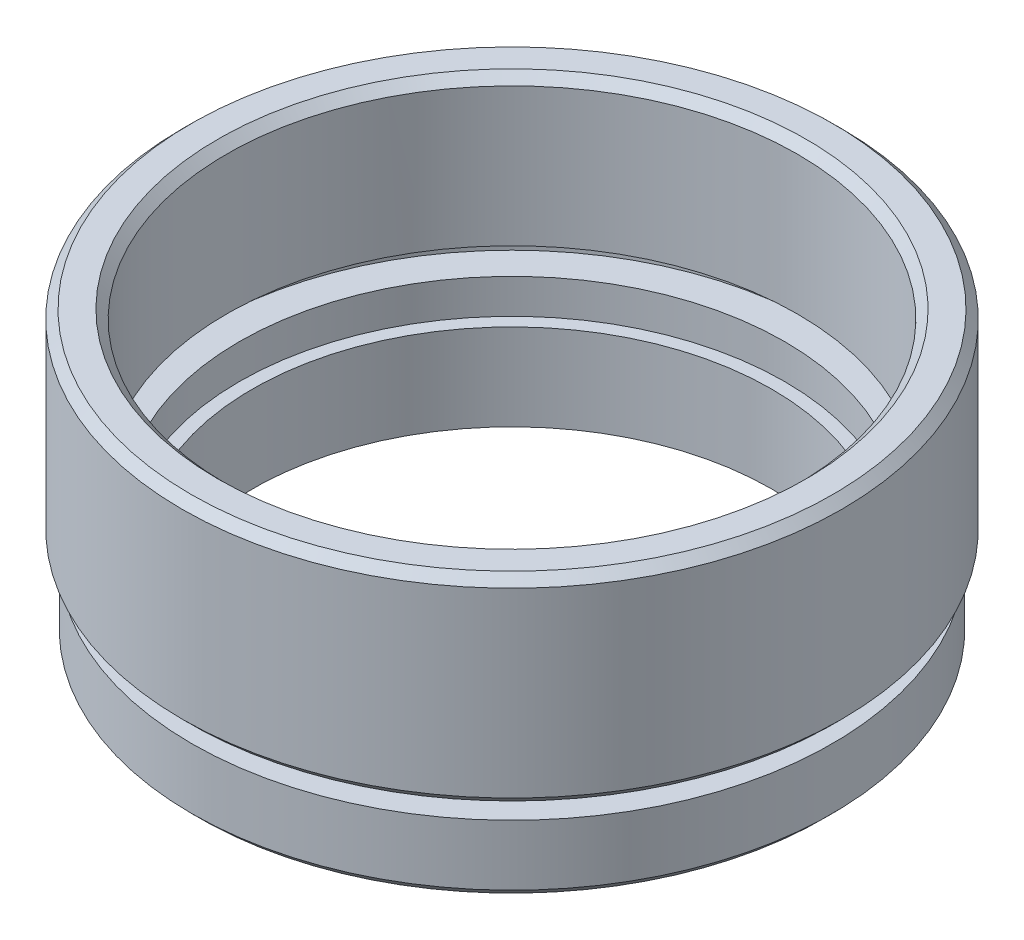
ISO-10303-21;
HEADER;
FILE_DESCRIPTION(('STEP AP214'),'2;1');
FILE_NAME('part.step','',(''),(''),'','','');
FILE_SCHEMA(('AUTOMOTIVE_DESIGN { 1 0 10303 214 1 1 1 1 }'));
ENDSEC;
DATA;
#1=APPLICATION_CONTEXT('core data for automotive mechanical design processes');
#2=APPLICATION_PROTOCOL_DEFINITION('international standard','automotive_design',2000,#1);
#3=PRODUCT_CONTEXT('',#1,'mechanical');
#4=PRODUCT('Part','Part','',(#3));
#5=PRODUCT_RELATED_PRODUCT_CATEGORY('part','',(#4));
#6=PRODUCT_DEFINITION_FORMATION('','',#4);
#7=PRODUCT_DEFINITION_CONTEXT('part definition',#1,'design');
#8=PRODUCT_DEFINITION('design','',#6,#7);
#9=PRODUCT_DEFINITION_SHAPE('','',#8);
#10=(LENGTH_UNIT() NAMED_UNIT(*) SI_UNIT(.MILLI.,.METRE.));
#11=(NAMED_UNIT(*) PLANE_ANGLE_UNIT() SI_UNIT($,.RADIAN.));
#12=(NAMED_UNIT(*) SI_UNIT($,.STERADIAN.) SOLID_ANGLE_UNIT());
#13=UNCERTAINTY_MEASURE_WITH_UNIT(LENGTH_MEASURE(1.E-05),#10,'distance_accuracy_value','');
#14=(GEOMETRIC_REPRESENTATION_CONTEXT(3) GLOBAL_UNCERTAINTY_ASSIGNED_CONTEXT((#13)) GLOBAL_UNIT_ASSIGNED_CONTEXT((#10,
#11,#12)) REPRESENTATION_CONTEXT('',''));
#15=CARTESIAN_POINT('',(0.,0.,0.));
#16=DIRECTION('',(0.,0.,1.));
#17=DIRECTION('',(1.,0.,0.));
#18=AXIS2_PLACEMENT_3D('',#15,#16,#17);
#19=CARTESIAN_POINT('',(0.,0.,0.));
#20=DIRECTION('',(0.,-1.,0.));
#21=DIRECTION('',(0.,0.,-1.));
#22=AXIS2_PLACEMENT_3D('',#19,#20,#21);
#23=CYLINDRICAL_SURFACE('',#22,15.);
#24=CARTESIAN_POINT('',(0.,0.,0.));
#25=DIRECTION('',(0.,-1.,0.));
#26=DIRECTION('',(0.,0.,-1.));
#27=AXIS2_PLACEMENT_3D('',#24,#25,#26);
#28=CIRCLE('',#27,15.);
#29=CARTESIAN_POINT('',(0.,0.,-15.));
#30=VERTEX_POINT('',#29);
#31=EDGE_CURVE('E67',#30,#30,#28,.T.);
#32=ORIENTED_EDGE('',*,*,#31,.T.);
#33=EDGE_LOOP('',(#32));
#34=FACE_BOUND('',#33,.T.);
#35=CARTESIAN_POINT('',(0.,5.,0.));
#36=DIRECTION('',(0.,-1.,0.));
#37=DIRECTION('',(0.,0.,-1.));
#38=AXIS2_PLACEMENT_3D('',#35,#36,#37);
#39=CIRCLE('',#38,15.);
#40=CARTESIAN_POINT('',(0.,5.,-15.));
#41=VERTEX_POINT('',#40);
#42=EDGE_CURVE('E94',#41,#41,#39,.T.);
#43=ORIENTED_EDGE('',*,*,#42,.F.);
#44=EDGE_LOOP('',(#43));
#45=FACE_BOUND('',#44,.T.);
#46=ADVANCED_FACE('F35',(#34,#45),#23,.F.);
#47=CARTESIAN_POINT('',(15.,0.,0.));
#48=DIRECTION('',(0.,-1.,0.));
#49=DIRECTION('',(0.,0.,-1.));
#50=AXIS2_PLACEMENT_3D('',#47,#48,#49);
#51=PLANE('',#50);
#52=CARTESIAN_POINT('',(0.,0.,0.));
#53=DIRECTION('',(0.,-1.,0.));
#54=DIRECTION('',(0.,0.,-1.));
#55=AXIS2_PLACEMENT_3D('',#52,#53,#54);
#56=CIRCLE('',#55,18.);
#57=CARTESIAN_POINT('',(0.,0.,-18.));
#58=VERTEX_POINT('',#57);
#59=EDGE_CURVE('E42',#58,#58,#56,.T.);
#60=ORIENTED_EDGE('',*,*,#59,.T.);
#61=EDGE_LOOP('',(#60));
#62=FACE_BOUND('',#61,.T.);
#63=ORIENTED_EDGE('',*,*,#31,.F.);
#64=EDGE_LOOP('',(#63));
#65=FACE_BOUND('',#64,.T.);
#66=ADVANCED_FACE('F102',(#62,#65),#51,.T.);
#67=CARTESIAN_POINT('',(0.,0.,0.));
#68=DIRECTION('',(0.,-1.,0.));
#69=DIRECTION('',(0.,0.,-1.));
#70=AXIS2_PLACEMENT_3D('',#67,#68,#69);
#71=CYLINDRICAL_SURFACE('',#70,18.5);
#72=CARTESIAN_POINT('',(0.,0.500000000000004,0.));
#73=DIRECTION('',(0.,-1.,0.));
#74=DIRECTION('',(0.,0.,-1.));
#75=AXIS2_PLACEMENT_3D('',#72,#73,#74);
#76=CIRCLE('',#75,18.5);
#77=CARTESIAN_POINT('',(0.,0.500000000000004,-18.5));
#78=VERTEX_POINT('',#77);
#79=EDGE_CURVE('E10',#78,#78,#76,.F.);
#80=ORIENTED_EDGE('',*,*,#79,.T.);
#81=EDGE_LOOP('',(#80));
#82=FACE_BOUND('',#81,.T.);
#83=CARTESIAN_POINT('',(0.,4.,0.));
#84=DIRECTION('',(0.,-1.,0.));
#85=DIRECTION('',(0.,0.,-1.));
#86=AXIS2_PLACEMENT_3D('',#83,#84,#85);
#87=CIRCLE('',#86,18.5);
#88=CARTESIAN_POINT('',(0.,4.,-18.5));
#89=VERTEX_POINT('',#88);
#90=EDGE_CURVE('E70',#89,#89,#87,.T.);
#91=ORIENTED_EDGE('',*,*,#90,.T.);
#92=EDGE_LOOP('',(#91));
#93=FACE_BOUND('',#92,.T.);
#94=ADVANCED_FACE('F108',(#82,#93),#71,.T.);
#95=CARTESIAN_POINT('',(18.5,4.,0.));
#96=DIRECTION('',(0.,1.,0.));
#97=DIRECTION('',(0.,0.,1.));
#98=AXIS2_PLACEMENT_3D('',#95,#96,#97);
#99=PLANE('',#98);
#100=CARTESIAN_POINT('',(0.,4.,0.));
#101=DIRECTION('',(0.,-1.,0.));
#102=DIRECTION('',(0.,0.,-1.));
#103=AXIS2_PLACEMENT_3D('',#100,#101,#102);
#104=CIRCLE('',#103,17.);
#105=CARTESIAN_POINT('',(0.,4.,-17.));
#106=VERTEX_POINT('',#105);
#107=EDGE_CURVE('E73',#106,#106,#104,.T.);
#108=ORIENTED_EDGE('',*,*,#107,.T.);
#109=EDGE_LOOP('',(#108));
#110=FACE_BOUND('',#109,.T.);
#111=ORIENTED_EDGE('',*,*,#90,.F.);
#112=EDGE_LOOP('',(#111));
#113=FACE_BOUND('',#112,.T.);
#114=ADVANCED_FACE('F140',(#110,#113),#99,.T.);
#115=CARTESIAN_POINT('',(0.,0.,0.));
#116=DIRECTION('',(0.,-1.,0.));
#117=DIRECTION('',(0.,0.,-1.));
#118=AXIS2_PLACEMENT_3D('',#115,#116,#117);
#119=CYLINDRICAL_SURFACE('',#118,17.);
#120=CARTESIAN_POINT('',(0.,5.,0.));
#121=DIRECTION('',(0.,-1.,0.));
#122=DIRECTION('',(0.,0.,-1.));
#123=AXIS2_PLACEMENT_3D('',#120,#121,#122);
#124=CIRCLE('',#123,17.);
#125=CARTESIAN_POINT('',(0.,5.,-17.));
#126=VERTEX_POINT('',#125);
#127=EDGE_CURVE('E76',#126,#126,#124,.T.);
#128=ORIENTED_EDGE('',*,*,#127,.T.);
#129=EDGE_LOOP('',(#128));
#130=FACE_BOUND('',#129,.T.);
#131=ORIENTED_EDGE('',*,*,#107,.F.);
#132=EDGE_LOOP('',(#131));
#133=FACE_BOUND('',#132,.T.);
#134=ADVANCED_FACE('F134',(#130,#133),#119,.T.);
#135=CARTESIAN_POINT('',(17.,5.,0.));
#136=DIRECTION('',(0.,-1.,0.));
#137=DIRECTION('',(0.,0.,-1.));
#138=AXIS2_PLACEMENT_3D('',#135,#136,#137);
#139=PLANE('',#138);
#140=CARTESIAN_POINT('',(0.,5.,0.));
#141=DIRECTION('',(0.,-1.,0.));
#142=DIRECTION('',(0.,0.,-1.));
#143=AXIS2_PLACEMENT_3D('',#140,#141,#142);
#144=CIRCLE('',#143,18.55);
#145=CARTESIAN_POINT('',(0.,5.,-18.55));
#146=VERTEX_POINT('',#145);
#147=EDGE_CURVE('E46',#146,#146,#144,.T.);
#148=ORIENTED_EDGE('',*,*,#147,.T.);
#149=EDGE_LOOP('',(#148));
#150=FACE_BOUND('',#149,.T.);
#151=ORIENTED_EDGE('',*,*,#127,.F.);
#152=EDGE_LOOP('',(#151));
#153=FACE_BOUND('',#152,.T.);
#154=ADVANCED_FACE('F130',(#150,#153),#139,.T.);
#155=CARTESIAN_POINT('',(0.,0.,0.));
#156=DIRECTION('',(0.,-1.,0.));
#157=DIRECTION('',(0.,0.,-1.));
#158=AXIS2_PLACEMENT_3D('',#155,#156,#157);
#159=CYLINDRICAL_SURFACE('',#158,19.05);
#160=CARTESIAN_POINT('',(0.,16.,0.));
#161=DIRECTION('',(0.,1.,0.));
#162=DIRECTION('',(0.,0.,1.));
#163=AXIS2_PLACEMENT_3D('',#160,#161,#162);
#164=CIRCLE('',#163,19.05);
#165=CARTESIAN_POINT('',(0.,16.,19.05));
#166=VERTEX_POINT('',#165);
#167=EDGE_CURVE('E50',#166,#166,#164,.F.);
#168=ORIENTED_EDGE('',*,*,#167,.T.);
#169=EDGE_LOOP('',(#168));
#170=FACE_BOUND('',#169,.T.);
#171=CARTESIAN_POINT('',(0.,5.50000000000001,0.));
#172=DIRECTION('',(0.,-1.,0.));
#173=DIRECTION('',(0.,0.,-1.));
#174=AXIS2_PLACEMENT_3D('',#171,#172,#173);
#175=CIRCLE('',#174,19.05);
#176=CARTESIAN_POINT('',(0.,5.50000000000001,-19.05));
#177=VERTEX_POINT('',#176);
#178=EDGE_CURVE('E55',#177,#177,#175,.F.);
#179=ORIENTED_EDGE('',*,*,#178,.T.);
#180=EDGE_LOOP('',(#179));
#181=FACE_BOUND('',#180,.T.);
#182=ADVANCED_FACE('F133',(#170,#181),#159,.T.);
#183=CARTESIAN_POINT('',(19.05,16.5,0.));
#184=DIRECTION('',(0.,1.,0.));
#185=DIRECTION('',(0.,0.,1.));
#186=AXIS2_PLACEMENT_3D('',#183,#184,#185);
#187=PLANE('',#186);
#188=CARTESIAN_POINT('',(0.,16.5,0.));
#189=DIRECTION('',(0.,1.,0.));
#190=DIRECTION('',(0.,0.,1.));
#191=AXIS2_PLACEMENT_3D('',#188,#189,#190);
#192=CIRCLE('',#191,17.);
#193=CARTESIAN_POINT('',(0.,16.5,17.));
#194=VERTEX_POINT('',#193);
#195=EDGE_CURVE('E61',#194,#194,#192,.F.);
#196=ORIENTED_EDGE('',*,*,#195,.T.);
#197=EDGE_LOOP('',(#196));
#198=FACE_BOUND('',#197,.T.);
#199=CARTESIAN_POINT('',(0.,16.5,0.));
#200=DIRECTION('',(0.,1.,0.));
#201=DIRECTION('',(0.,0.,1.));
#202=AXIS2_PLACEMENT_3D('',#199,#200,#201);
#203=CIRCLE('',#202,18.55);
#204=CARTESIAN_POINT('',(0.,16.5,18.55));
#205=VERTEX_POINT('',#204);
#206=EDGE_CURVE('E64',#205,#205,#203,.T.);
#207=ORIENTED_EDGE('',*,*,#206,.T.);
#208=EDGE_LOOP('',(#207));
#209=FACE_BOUND('',#208,.T.);
#210=ADVANCED_FACE('F155',(#198,#209),#187,.T.);
#211=CARTESIAN_POINT('',(0.,0.,0.));
#212=DIRECTION('',(0.,-1.,0.));
#213=DIRECTION('',(0.,0.,-1.));
#214=AXIS2_PLACEMENT_3D('',#211,#212,#213);
#215=CYLINDRICAL_SURFACE('',#214,16.5);
#216=CARTESIAN_POINT('',(0.,16.,0.));
#217=DIRECTION('',(0.,1.,0.));
#218=DIRECTION('',(0.,0.,1.));
#219=AXIS2_PLACEMENT_3D('',#216,#217,#218);
#220=CIRCLE('',#219,16.5);
#221=CARTESIAN_POINT('',(0.,16.,16.5));
#222=VERTEX_POINT('',#221);
#223=EDGE_CURVE('E58',#222,#222,#220,.T.);
#224=ORIENTED_EDGE('',*,*,#223,.T.);
#225=EDGE_LOOP('',(#224));
#226=FACE_BOUND('',#225,.T.);
#227=CARTESIAN_POINT('',(0.,8.,0.));
#228=DIRECTION('',(0.,-1.,0.));
#229=DIRECTION('',(0.,0.,-1.));
#230=AXIS2_PLACEMENT_3D('',#227,#228,#229);
#231=CIRCLE('',#230,16.5);
#232=CARTESIAN_POINT('',(0.,8.,-16.5));
#233=VERTEX_POINT('',#232);
#234=EDGE_CURVE('E79',#233,#233,#231,.T.);
#235=ORIENTED_EDGE('',*,*,#234,.T.);
#236=EDGE_LOOP('',(#235));
#237=FACE_BOUND('',#236,.T.);
#238=ADVANCED_FACE('F159',(#226,#237),#215,.F.);
#239=CARTESIAN_POINT('',(16.5,8.,0.));
#240=DIRECTION('',(0.,-1.,0.));
#241=DIRECTION('',(0.,0.,-1.));
#242=AXIS2_PLACEMENT_3D('',#239,#240,#241);
#243=PLANE('',#242);
#244=CARTESIAN_POINT('',(0.,8.,0.));
#245=DIRECTION('',(0.,-1.,0.));
#246=DIRECTION('',(0.,0.,-1.));
#247=AXIS2_PLACEMENT_3D('',#244,#245,#246);
#248=CIRCLE('',#247,17.6);
#249=CARTESIAN_POINT('',(0.,8.,-17.6));
#250=VERTEX_POINT('',#249);
#251=EDGE_CURVE('E82',#250,#250,#248,.T.);
#252=ORIENTED_EDGE('',*,*,#251,.T.);
#253=EDGE_LOOP('',(#252));
#254=FACE_BOUND('',#253,.T.);
#255=ORIENTED_EDGE('',*,*,#234,.F.);
#256=EDGE_LOOP('',(#255));
#257=FACE_BOUND('',#256,.T.);
#258=ADVANCED_FACE('F163',(#254,#257),#243,.T.);
#259=CARTESIAN_POINT('',(0.,0.,0.));
#260=DIRECTION('',(0.,-1.,0.));
#261=DIRECTION('',(0.,0.,-1.));
#262=AXIS2_PLACEMENT_3D('',#259,#260,#261);
#263=CYLINDRICAL_SURFACE('',#262,17.6);
#264=CARTESIAN_POINT('',(0.,7.,0.));
#265=DIRECTION('',(0.,-1.,0.));
#266=DIRECTION('',(0.,0.,-1.));
#267=AXIS2_PLACEMENT_3D('',#264,#265,#266);
#268=CIRCLE('',#267,17.6);
#269=CARTESIAN_POINT('',(0.,7.,-17.6));
#270=VERTEX_POINT('',#269);
#271=EDGE_CURVE('E85',#270,#270,#268,.T.);
#272=ORIENTED_EDGE('',*,*,#271,.T.);
#273=EDGE_LOOP('',(#272));
#274=FACE_BOUND('',#273,.T.);
#275=ORIENTED_EDGE('',*,*,#251,.F.);
#276=EDGE_LOOP('',(#275));
#277=FACE_BOUND('',#276,.T.);
#278=ADVANCED_FACE('F167',(#274,#277),#263,.F.);
#279=CARTESIAN_POINT('',(17.6,7.,0.));
#280=DIRECTION('',(0.,1.,0.));
#281=DIRECTION('',(0.,0.,1.));
#282=AXIS2_PLACEMENT_3D('',#279,#280,#281);
#283=PLANE('',#282);
#284=CARTESIAN_POINT('',(0.,7.,0.));
#285=DIRECTION('',(0.,-1.,0.));
#286=DIRECTION('',(0.,0.,-1.));
#287=AXIS2_PLACEMENT_3D('',#284,#285,#286);
#288=CIRCLE('',#287,15.75);
#289=CARTESIAN_POINT('',(0.,7.,-15.75));
#290=VERTEX_POINT('',#289);
#291=EDGE_CURVE('E88',#290,#290,#288,.T.);
#292=ORIENTED_EDGE('',*,*,#291,.T.);
#293=EDGE_LOOP('',(#292));
#294=FACE_BOUND('',#293,.T.);
#295=ORIENTED_EDGE('',*,*,#271,.F.);
#296=EDGE_LOOP('',(#295));
#297=FACE_BOUND('',#296,.T.);
#298=ADVANCED_FACE('F171',(#294,#297),#283,.T.);
#299=CARTESIAN_POINT('',(0.,0.,0.));
#300=DIRECTION('',(0.,-1.,0.));
#301=DIRECTION('',(0.,0.,-1.));
#302=AXIS2_PLACEMENT_3D('',#299,#300,#301);
#303=CYLINDRICAL_SURFACE('',#302,15.75);
#304=CARTESIAN_POINT('',(0.,5.,0.));
#305=DIRECTION('',(0.,-1.,0.));
#306=DIRECTION('',(0.,0.,-1.));
#307=AXIS2_PLACEMENT_3D('',#304,#305,#306);
#308=CIRCLE('',#307,15.75);
#309=CARTESIAN_POINT('',(0.,5.,-15.75));
#310=VERTEX_POINT('',#309);
#311=EDGE_CURVE('E91',#310,#310,#308,.T.);
#312=ORIENTED_EDGE('',*,*,#311,.T.);
#313=EDGE_LOOP('',(#312));
#314=FACE_BOUND('',#313,.T.);
#315=ORIENTED_EDGE('',*,*,#291,.F.);
#316=EDGE_LOOP('',(#315));
#317=FACE_BOUND('',#316,.T.);
#318=ADVANCED_FACE('F175',(#314,#317),#303,.F.);
#319=CARTESIAN_POINT('',(15.75,5.,0.));
#320=DIRECTION('',(0.,1.,0.));
#321=DIRECTION('',(0.,0.,1.));
#322=AXIS2_PLACEMENT_3D('',#319,#320,#321);
#323=PLANE('',#322);
#324=ORIENTED_EDGE('',*,*,#42,.T.);
#325=EDGE_LOOP('',(#324));
#326=FACE_BOUND('',#325,.T.);
#327=ORIENTED_EDGE('',*,*,#311,.F.);
#328=EDGE_LOOP('',(#327));
#329=FACE_BOUND('',#328,.T.);
#330=ADVANCED_FACE('F98',(#326,#329),#323,.T.);
#331=CARTESIAN_POINT('',(0.,16.5,0.));
#332=DIRECTION('',(0.,1.,0.));
#333=DIRECTION('',(0.,0.,1.));
#334=AXIS2_PLACEMENT_3D('',#331,#332,#333);
#335=CONICAL_SURFACE('',#334,17.,0.785398163397448);
#336=ORIENTED_EDGE('',*,*,#223,.F.);
#337=EDGE_LOOP('',(#336));
#338=FACE_BOUND('',#337,.T.);
#339=ORIENTED_EDGE('',*,*,#195,.F.);
#340=EDGE_LOOP('',(#339));
#341=FACE_BOUND('',#340,.T.);
#342=ADVANCED_FACE('F112',(#338,#341),#335,.F.);
#343=CARTESIAN_POINT('',(0.,16.,0.));
#344=DIRECTION('',(0.,-1.,0.));
#345=DIRECTION('',(0.,0.,-1.));
#346=AXIS2_PLACEMENT_3D('',#343,#344,#345);
#347=CONICAL_SURFACE('',#346,19.05,0.785398163397448);
#348=ORIENTED_EDGE('',*,*,#206,.F.);
#349=EDGE_LOOP('',(#348));
#350=FACE_BOUND('',#349,.T.);
#351=ORIENTED_EDGE('',*,*,#167,.F.);
#352=EDGE_LOOP('',(#351));
#353=FACE_BOUND('',#352,.T.);
#354=ADVANCED_FACE('F115',(#350,#353),#347,.T.);
#355=CARTESIAN_POINT('',(0.,5.,0.));
#356=DIRECTION('',(0.,1.,0.));
#357=DIRECTION('',(0.,0.,1.));
#358=AXIS2_PLACEMENT_3D('',#355,#356,#357);
#359=CONICAL_SURFACE('',#358,18.55,0.785398163397441);
#360=ORIENTED_EDGE('',*,*,#178,.F.);
#361=EDGE_LOOP('',(#360));
#362=FACE_BOUND('',#361,.T.);
#363=ORIENTED_EDGE('',*,*,#147,.F.);
#364=EDGE_LOOP('',(#363));
#365=FACE_BOUND('',#364,.T.);
#366=ADVANCED_FACE('F118',(#362,#365),#359,.T.);
#367=CARTESIAN_POINT('',(0.,0.,0.));
#368=DIRECTION('',(0.,1.,0.));
#369=DIRECTION('',(0.,0.,1.));
#370=AXIS2_PLACEMENT_3D('',#367,#368,#369);
#371=CONICAL_SURFACE('',#370,18.,0.785398163397445);
#372=ORIENTED_EDGE('',*,*,#79,.F.);
#373=EDGE_LOOP('',(#372));
#374=FACE_BOUND('',#373,.T.);
#375=ORIENTED_EDGE('',*,*,#59,.F.);
#376=EDGE_LOOP('',(#375));
#377=FACE_BOUND('',#376,.T.);
#378=ADVANCED_FACE('F37',(#374,#377),#371,.T.);
#379=CLOSED_SHELL('',(#46,#66,#94,#114,#134,#154,#182,#210,#238,#258,#278,#298,#318,#330,#342,
#354,#366,#378));
#380=MANIFOLD_SOLID_BREP('B2',#379);
#381=ADVANCED_BREP_SHAPE_REPRESENTATION('',(#18,#380),#14);
#382=SHAPE_DEFINITION_REPRESENTATION(#9,#381);
ENDSEC;
END-ISO-10303-21;
